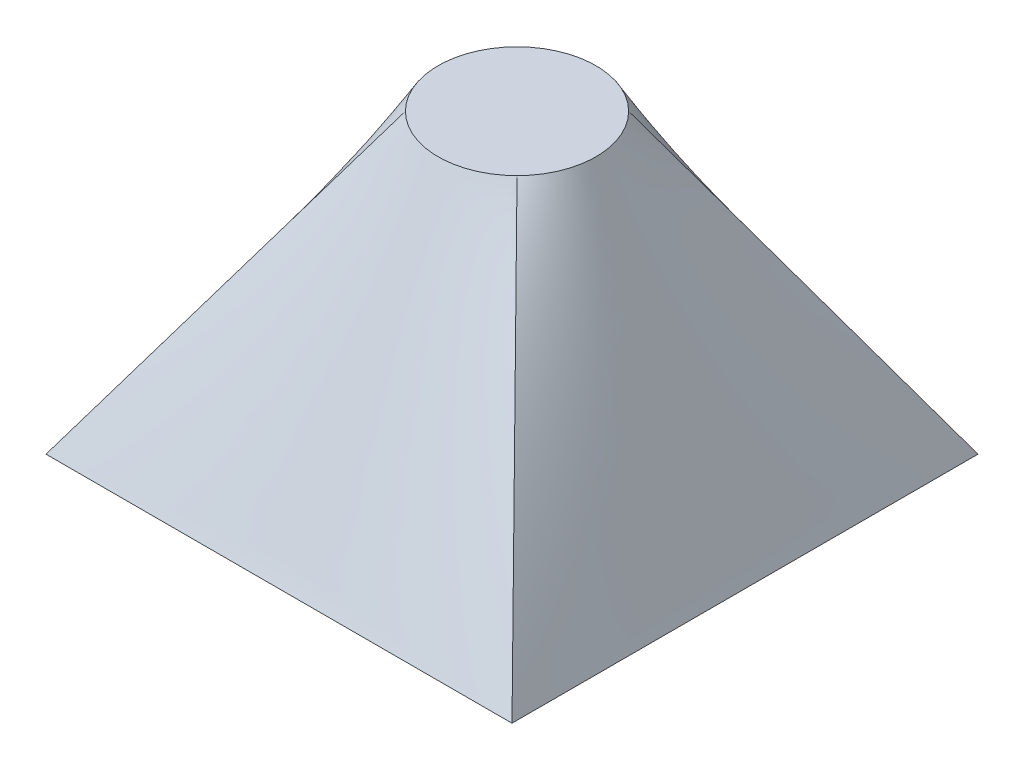
ISO-10303-21;
HEADER;
FILE_DESCRIPTION(('STEP AP214'),'2;1');
FILE_NAME('part.step','',(''),(''),'','','');
FILE_SCHEMA(('AUTOMOTIVE_DESIGN { 1 0 10303 214 1 1 1 1 }'));
ENDSEC;
DATA;
#1=APPLICATION_CONTEXT('core data for automotive mechanical design processes');
#2=APPLICATION_PROTOCOL_DEFINITION('international standard','automotive_design',2000,#1);
#3=PRODUCT_CONTEXT('',#1,'mechanical');
#4=PRODUCT('Part','Part','',(#3));
#5=PRODUCT_RELATED_PRODUCT_CATEGORY('part','',(#4));
#6=PRODUCT_DEFINITION_FORMATION('','',#4);
#7=PRODUCT_DEFINITION_CONTEXT('part definition',#1,'design');
#8=PRODUCT_DEFINITION('design','',#6,#7);
#9=PRODUCT_DEFINITION_SHAPE('','',#8);
#10=(LENGTH_UNIT() NAMED_UNIT(*) SI_UNIT(.MILLI.,.METRE.));
#11=(NAMED_UNIT(*) PLANE_ANGLE_UNIT() SI_UNIT($,.RADIAN.));
#12=(NAMED_UNIT(*) SI_UNIT($,.STERADIAN.) SOLID_ANGLE_UNIT());
#13=UNCERTAINTY_MEASURE_WITH_UNIT(LENGTH_MEASURE(1.E-05),#10,'distance_accuracy_value','');
#14=(GEOMETRIC_REPRESENTATION_CONTEXT(3) GLOBAL_UNCERTAINTY_ASSIGNED_CONTEXT((#13)) GLOBAL_UNIT_ASSIGNED_CONTEXT((#10,
#11,#12)) REPRESENTATION_CONTEXT('',''));
#15=CARTESIAN_POINT('',(0.,0.,0.));
#16=DIRECTION('',(0.,0.,1.));
#17=DIRECTION('',(1.,0.,0.));
#18=AXIS2_PLACEMENT_3D('',#15,#16,#17);
#19=CARTESIAN_POINT('',(0.,0.,0.));
#20=DIRECTION('',(0.,-1.,0.));
#21=DIRECTION('',(0.,0.,-1.));
#22=AXIS2_PLACEMENT_3D('',#19,#20,#21);
#23=PLANE('',#22);
#24=DIRECTION('',(0.,0.,1.));
#25=VECTOR('',#24,1.);
#26=CARTESIAN_POINT('',(0.,0.,0.));
#27=LINE('',#26,#25);
#28=CARTESIAN_POINT('',(0.,0.,-30.));
#29=VERTEX_POINT('',#28);
#30=CARTESIAN_POINT('',(0.,0.,0.));
#31=VERTEX_POINT('',#30);
#32=EDGE_CURVE('E211',#29,#31,#27,.T.);
#33=ORIENTED_EDGE('',*,*,#32,.F.);
#34=DIRECTION('',(-1.,0.,0.));
#35=VECTOR('',#34,1.);
#36=CARTESIAN_POINT('',(0.,0.,-30.));
#37=LINE('',#36,#35);
#38=CARTESIAN_POINT('',(30.,0.,-30.));
#39=VERTEX_POINT('',#38);
#40=EDGE_CURVE('E117',#39,#29,#37,.T.);
#41=ORIENTED_EDGE('',*,*,#40,.F.);
#42=DIRECTION('',(0.,0.,-1.));
#43=VECTOR('',#42,1.);
#44=CARTESIAN_POINT('',(30.,0.,0.));
#45=LINE('',#44,#43);
#46=CARTESIAN_POINT('',(30.,0.,0.));
#47=VERTEX_POINT('',#46);
#48=EDGE_CURVE('E73',#47,#39,#45,.T.);
#49=ORIENTED_EDGE('',*,*,#48,.F.);
#50=DIRECTION('',(1.,0.,0.));
#51=VECTOR('',#50,1.);
#52=CARTESIAN_POINT('',(0.,0.,0.));
#53=LINE('',#52,#51);
#54=EDGE_CURVE('E12',#31,#47,#53,.T.);
#55=ORIENTED_EDGE('',*,*,#54,.F.);
#56=EDGE_LOOP('',(#33,#41,#49,#55));
#57=FACE_BOUND('',#56,.T.);
#58=ADVANCED_FACE('F63',(#57),#23,.T.);
#59=CARTESIAN_POINT('',(16.0415424235225,20.,-14.282727634071));
#60=DIRECTION('',(0.,1.,0.));
#61=DIRECTION('',(0.,0.,1.));
#62=AXIS2_PLACEMENT_3D('',#59,#60,#61);
#63=PLANE('',#62);
#64=CARTESIAN_POINT('',(16.0415424235225,20.,-14.282727634071));
#65=DIRECTION('',(0.,1.,0.));
#66=DIRECTION('',(0.,0.,1.));
#67=AXIS2_PLACEMENT_3D('',#64,#65,#66);
#68=CIRCLE('',#67,5.08132820547587);
#69=CARTESIAN_POINT('',(12.4485007919961,20.,-17.8757692655975));
#70=VERTEX_POINT('',#69);
#71=CARTESIAN_POINT('',(12.4485007919961,20.,-10.6896860025445));
#72=VERTEX_POINT('',#71);
#73=EDGE_CURVE('E124',#70,#72,#68,.T.);
#74=ORIENTED_EDGE('',*,*,#73,.T.);
#75=CARTESIAN_POINT('',(19.634584055049,20.,-10.6896860025445));
#76=VERTEX_POINT('',#75);
#77=EDGE_CURVE('E131',#72,#76,#68,.T.);
#78=ORIENTED_EDGE('',*,*,#77,.T.);
#79=CARTESIAN_POINT('',(19.634584055049,20.,-17.8757692655975));
#80=VERTEX_POINT('',#79);
#81=EDGE_CURVE('E137',#76,#80,#68,.T.);
#82=ORIENTED_EDGE('',*,*,#81,.T.);
#83=EDGE_CURVE('E113',#80,#70,#68,.T.);
#84=ORIENTED_EDGE('',*,*,#83,.T.);
#85=EDGE_LOOP('',(#74,#78,#82,#84));
#86=FACE_BOUND('',#85,.T.);
#87=ADVANCED_FACE('F136',(#86),#63,.T.);
#88=CARTESIAN_POINT('',(19.634584055049,20.,-10.6896860025445));
#89=CARTESIAN_POINT('',(30.,0.,0.));
#90=CARTESIAN_POINT('',(19.211140037926,20.,-10.2662419854215));
#91=CARTESIAN_POINT('',(27.5,0.,0.));
#92=CARTESIAN_POINT('',(18.6771229039422,20.,-9.88657285693689));
#93=CARTESIAN_POINT('',(25.,0.,0.));
#94=CARTESIAN_POINT('',(17.7510348709474,20.,-9.48578348760202));
#95=CARTESIAN_POINT('',(21.25,0.,0.));
#96=CARTESIAN_POINT('',(17.4224609605513,20.,-9.38033857962967));
#97=CARTESIAN_POINT('',(20.,0.,0.));
#98=CARTESIAN_POINT('',(16.7430484707322,20.,-9.23810240391327));
#99=CARTESIAN_POINT('',(17.5,0.,0.));
#100=CARTESIAN_POINT('',(16.3923349331187,20.,-9.20139942859512));
#101=CARTESIAN_POINT('',(16.25,0.,0.));
#102=CARTESIAN_POINT('',(15.6907499139263,20.,-9.20139942859513));
#103=CARTESIAN_POINT('',(13.75,0.,0.));
#104=CARTESIAN_POINT('',(15.3400363763128,20.,-9.23810240391326));
#105=CARTESIAN_POINT('',(12.5,0.,0.));
#106=CARTESIAN_POINT('',(14.6606238864938,20.,-9.38033857962967));
#107=CARTESIAN_POINT('',(9.99999999999997,0.,0.));
#108=CARTESIAN_POINT('',(14.3320499760977,20.,-9.48578348760202));
#109=CARTESIAN_POINT('',(8.74999999999998,0.,0.));
#110=CARTESIAN_POINT('',(13.4059619431028,20.,-9.88657285693689));
#111=CARTESIAN_POINT('',(4.99999999999998,0.,0.));
#112=CARTESIAN_POINT('',(12.871944809119,20.,-10.2662419854215));
#113=CARTESIAN_POINT('',(2.49999999999999,0.,0.));
#114=CARTESIAN_POINT('',(12.4485007919961,20.,-10.6896860025445));
#115=CARTESIAN_POINT('',(0.,0.,0.));
#116=B_SPLINE_SURFACE_WITH_KNOTS('',3,1,((#88,#89),(#90,#91),(#92,#93),(#94,#95),(#96,#97),(#98,
#99),(#100,#101),(#102,#103),(#104,#105),(#106,#107),(#108,#109),(#110,#111),(#112,#113),(#114,
#115)),.UNSPECIFIED.,.F.,.F.,.F.,(4,2,2,2,2,2,4),(2,2),(0.,0.25,0.375,0.5,0.625,0.75,1.),(0.,
1.),.UNSPECIFIED.);
#117=DIRECTION('',(-0.48120249616266,-0.773109154593228,0.413214705414714));
#118=VECTOR('',#117,1.);
#119=CARTESIAN_POINT('',(6.22425039599803,10.,-5.34484300127227));
#120=LINE('',#119,#118);
#121=EDGE_CURVE('E121',#72,#31,#120,.T.);
#122=DIRECTION('',(-0.415711823368911,0.802113153156007,-0.428716887287431));
#123=VECTOR('',#122,1.);
#124=CARTESIAN_POINT('',(24.8172920275245,10.,-5.34484300127227));
#125=LINE('',#124,#123);
#126=EDGE_CURVE('E81',#47,#76,#125,.T.);
#127=ORIENTED_EDGE('',*,*,#77,.F.);
#128=ORIENTED_EDGE('',*,*,#121,.T.);
#129=ORIENTED_EDGE('',*,*,#54,.T.);
#130=ORIENTED_EDGE('',*,*,#126,.T.);
#131=EDGE_LOOP('',(#127,#128,#129,#130));
#132=FACE_BOUND('',#131,.T.);
#133=ADVANCED_FACE('F158',(#132),#116,.T.);
#134=CARTESIAN_POINT('',(12.4485007919961,20.,-10.6896860025445));
#135=CARTESIAN_POINT('',(0.,0.,0.));
#136=CARTESIAN_POINT('',(12.0250567748731,20.,-11.1131300196675));
#137=CARTESIAN_POINT('',(0.,0.,-2.5));
#138=CARTESIAN_POINT('',(11.6453876463884,20.,-11.6471471536513));
#139=CARTESIAN_POINT('',(0.,0.,-5.));
#140=CARTESIAN_POINT('',(11.2445982770535,20.,-12.5732351866462));
#141=CARTESIAN_POINT('',(0.,0.,-8.75));
#142=CARTESIAN_POINT('',(11.1391533690812,20.,-12.9018090970422));
#143=CARTESIAN_POINT('',(0.,0.,-10.));
#144=CARTESIAN_POINT('',(10.9969171933648,20.,-13.5812215868613));
#145=CARTESIAN_POINT('',(0.,0.,-12.5));
#146=CARTESIAN_POINT('',(10.9602142180466,20.,-13.9319351244748));
#147=CARTESIAN_POINT('',(0.,0.,-13.75));
#148=CARTESIAN_POINT('',(10.9602142180466,20.,-14.6335201436672));
#149=CARTESIAN_POINT('',(0.,0.,-16.25));
#150=CARTESIAN_POINT('',(10.9969171933648,20.,-14.9842336812807));
#151=CARTESIAN_POINT('',(0.,0.,-17.5));
#152=CARTESIAN_POINT('',(11.1391533690812,20.,-15.6636461710998));
#153=CARTESIAN_POINT('',(0.,0.,-20.));
#154=CARTESIAN_POINT('',(11.2445982770535,20.,-15.9922200814958));
#155=CARTESIAN_POINT('',(0.,0.,-21.25));
#156=CARTESIAN_POINT('',(11.6453876463884,20.,-16.9183081144907));
#157=CARTESIAN_POINT('',(0.,0.,-25.));
#158=CARTESIAN_POINT('',(12.0250567748731,20.,-17.4523252484745));
#159=CARTESIAN_POINT('',(0.,0.,-27.5));
#160=CARTESIAN_POINT('',(12.4485007919961,20.,-17.8757692655975));
#161=CARTESIAN_POINT('',(0.,0.,-30.));
#162=B_SPLINE_SURFACE_WITH_KNOTS('',3,1,((#134,#135),(#136,#137),(#138,#139),(#140,#141),(#142,
#143),(#144,#145),(#146,#147),(#148,#149),(#150,#151),(#152,#153),(#154,#155),(#156,#157),(#158,
#159),(#160,#161)),.UNSPECIFIED.,.F.,.F.,.F.,(4,2,2,2,2,2,4),(2,2),(0.,0.25,0.375,0.5,0.625,
0.75,1.),(0.,1.),.UNSPECIFIED.);
#163=DIRECTION('',(-0.469851054336018,-0.75487171055669,-0.457611939683122));
#164=VECTOR('',#163,1.);
#165=CARTESIAN_POINT('',(6.22425039599803,10.,-23.9378846327987));
#166=LINE('',#165,#164);
#167=EDGE_CURVE('E108',#70,#29,#166,.T.);
#168=ORIENTED_EDGE('',*,*,#73,.F.);
#169=ORIENTED_EDGE('',*,*,#167,.T.);
#170=ORIENTED_EDGE('',*,*,#32,.T.);
#171=ORIENTED_EDGE('',*,*,#121,.F.);
#172=EDGE_LOOP('',(#168,#169,#170,#171));
#173=FACE_BOUND('',#172,.T.);
#174=ADVANCED_FACE('F126',(#173),#162,.T.);
#175=CARTESIAN_POINT('',(19.634584055049,20.,-17.8757692655975));
#176=CARTESIAN_POINT('',(30.,0.,-30.));
#177=CARTESIAN_POINT('',(20.058028072172,20.,-17.4523252484745));
#178=CARTESIAN_POINT('',(30.,0.,-27.5000000000001));
#179=CARTESIAN_POINT('',(20.4376972006566,20.,-16.9183081144907));
#180=CARTESIAN_POINT('',(30.,0.,-25.0000000000001));
#181=CARTESIAN_POINT('',(20.8384865699915,20.,-15.9922200814958));
#182=CARTESIAN_POINT('',(30.,0.,-21.2500000000002));
#183=CARTESIAN_POINT('',(20.9439314779638,20.,-15.6636461710998));
#184=CARTESIAN_POINT('',(30.,0.,-20.0000000000002));
#185=CARTESIAN_POINT('',(21.0861676536802,20.,-14.9842336812807));
#186=CARTESIAN_POINT('',(30.,0.,-17.5000000000002));
#187=CARTESIAN_POINT('',(21.1228706289984,20.,-14.6335201436672));
#188=CARTESIAN_POINT('',(30.,0.,-16.2500000000002));
#189=CARTESIAN_POINT('',(21.1228706289984,20.,-13.9319351244748));
#190=CARTESIAN_POINT('',(30.,0.,-13.7500000000002));
#191=CARTESIAN_POINT('',(21.0861676536802,20.,-13.5812215868613));
#192=CARTESIAN_POINT('',(30.,0.,-12.5000000000002));
#193=CARTESIAN_POINT('',(20.9439314779638,20.,-12.9018090970422));
#194=CARTESIAN_POINT('',(30.,0.,-10.0000000000002));
#195=CARTESIAN_POINT('',(20.8384865699915,20.,-12.5732351866462));
#196=CARTESIAN_POINT('',(30.,0.,-8.75000000000022));
#197=CARTESIAN_POINT('',(20.4376972006566,20.,-11.6471471536513));
#198=CARTESIAN_POINT('',(30.,0.,-5.00000000000015));
#199=CARTESIAN_POINT('',(20.058028072172,20.,-11.1131300196675));
#200=CARTESIAN_POINT('',(30.,0.,-2.50000000000009));
#201=CARTESIAN_POINT('',(19.634584055049,20.,-10.6896860025445));
#202=CARTESIAN_POINT('',(30.,0.,0.));
#203=B_SPLINE_SURFACE_WITH_KNOTS('',3,1,((#175,#176),(#177,#178),(#179,#180),(#181,#182),(#183,
#184),(#185,#186),(#187,#188),(#189,#190),(#191,#192),(#193,#194),(#195,#196),(#197,#198),(#199,
#200),(#201,#202)),.UNSPECIFIED.,.F.,.F.,.F.,(4,2,2,2,2,2,4),(2,2),(0.,0.25,0.375,0.5,0.625,
0.75,1.),(0.,1.),.UNSPECIFIED.);
#204=DIRECTION('',(0.405183926029306,-0.781799646403327,-0.473935965053413));
#205=VECTOR('',#204,1.);
#206=CARTESIAN_POINT('',(24.8172920275245,10.,-23.9378846327987));
#207=LINE('',#206,#205);
#208=EDGE_CURVE('E120',#80,#39,#207,.T.);
#209=ORIENTED_EDGE('',*,*,#81,.F.);
#210=ORIENTED_EDGE('',*,*,#126,.F.);
#211=ORIENTED_EDGE('',*,*,#48,.T.);
#212=ORIENTED_EDGE('',*,*,#208,.F.);
#213=EDGE_LOOP('',(#209,#210,#211,#212));
#214=FACE_BOUND('',#213,.T.);
#215=ADVANCED_FACE('F190',(#214),#203,.T.);
#216=CARTESIAN_POINT('',(12.4485007919961,20.,-17.8757692655975));
#217=CARTESIAN_POINT('',(0.,0.,-30.));
#218=CARTESIAN_POINT('',(12.871944809119,20.,-18.2992132827204));
#219=CARTESIAN_POINT('',(2.5,0.,-30.));
#220=CARTESIAN_POINT('',(13.4059619431028,20.,-18.6788824112051));
#221=CARTESIAN_POINT('',(4.99999999999999,0.,-30.));
#222=CARTESIAN_POINT('',(14.3320499760977,20.,-19.07967178054));
#223=CARTESIAN_POINT('',(8.74999999999999,0.,-30.));
#224=CARTESIAN_POINT('',(14.6606238864938,20.,-19.1851166885123));
#225=CARTESIAN_POINT('',(9.99999999999999,0.,-30.));
#226=CARTESIAN_POINT('',(15.3400363763128,20.,-19.3273528642287));
#227=CARTESIAN_POINT('',(12.5,0.,-30.));
#228=CARTESIAN_POINT('',(15.6907499139263,20.,-19.3640558395469));
#229=CARTESIAN_POINT('',(13.75,0.,-30.));
#230=CARTESIAN_POINT('',(16.3923349331187,20.,-19.3640558395469));
#231=CARTESIAN_POINT('',(16.25,0.,-30.));
#232=CARTESIAN_POINT('',(16.7430484707322,20.,-19.3273528642287));
#233=CARTESIAN_POINT('',(17.5,0.,-30.));
#234=CARTESIAN_POINT('',(17.4224609605513,20.,-19.1851166885123));
#235=CARTESIAN_POINT('',(20.,0.,-30.));
#236=CARTESIAN_POINT('',(17.7510348709474,20.,-19.07967178054));
#237=CARTESIAN_POINT('',(21.25,0.,-30.));
#238=CARTESIAN_POINT('',(18.6771229039422,20.,-18.6788824112051));
#239=CARTESIAN_POINT('',(25.,0.,-30.));
#240=CARTESIAN_POINT('',(19.211140037926,20.,-18.2992132827204));
#241=CARTESIAN_POINT('',(27.5,0.,-30.));
#242=CARTESIAN_POINT('',(19.634584055049,20.,-17.8757692655975));
#243=CARTESIAN_POINT('',(30.,0.,-30.));
#244=B_SPLINE_SURFACE_WITH_KNOTS('',3,1,((#216,#217),(#218,#219),(#220,#221),(#222,#223),(#224,
#225),(#226,#227),(#228,#229),(#230,#231),(#232,#233),(#234,#235),(#236,#237),(#238,#239),(#240,
#241),(#242,#243)),.UNSPECIFIED.,.F.,.F.,.F.,(4,2,2,2,2,2,4),(2,2),(0.,0.25,0.375,0.5,0.625,
0.75,1.),(0.,1.),.UNSPECIFIED.);
#245=ORIENTED_EDGE('',*,*,#83,.F.);
#246=ORIENTED_EDGE('',*,*,#208,.T.);
#247=ORIENTED_EDGE('',*,*,#40,.T.);
#248=ORIENTED_EDGE('',*,*,#167,.F.);
#249=EDGE_LOOP('',(#245,#246,#247,#248));
#250=FACE_BOUND('',#249,.T.);
#251=ADVANCED_FACE('F110',(#250),#244,.T.);
#252=CLOSED_SHELL('',(#58,#87,#133,#174,#215,#251));
#253=MANIFOLD_SOLID_BREP('B2',#252);
#254=ADVANCED_BREP_SHAPE_REPRESENTATION('',(#18,#253),#14);
#255=SHAPE_DEFINITION_REPRESENTATION(#9,#254);
ENDSEC;
END-ISO-10303-21;
